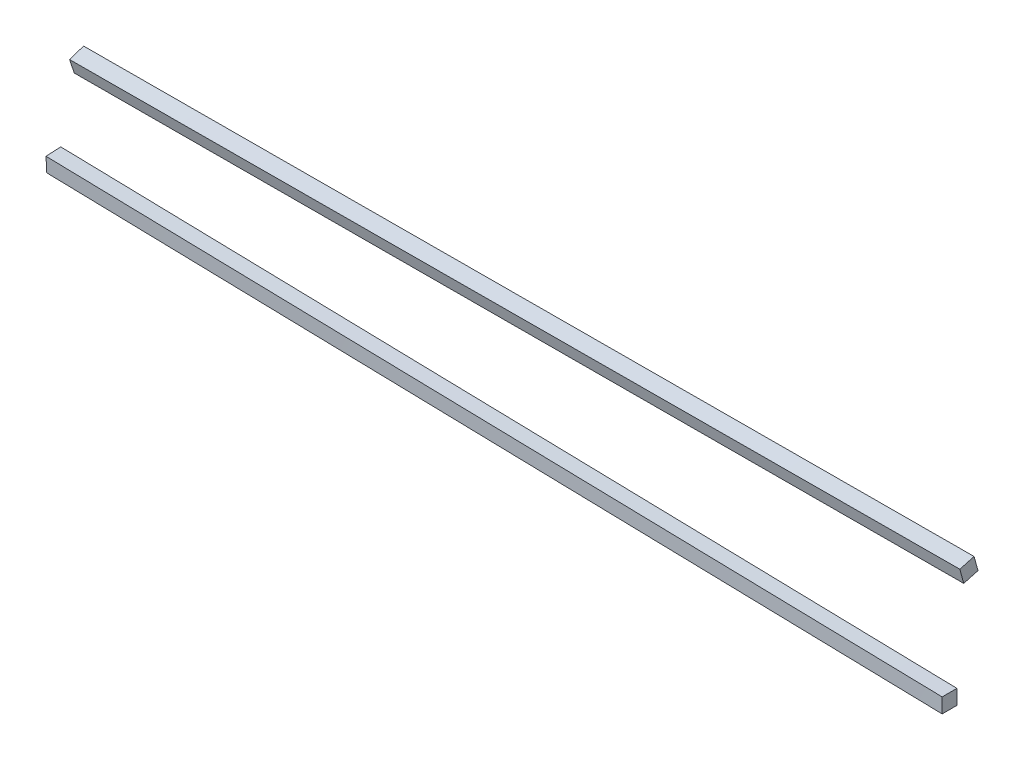
ISO-10303-21;
HEADER;
FILE_DESCRIPTION(('STEP AP214'),'2;1');
FILE_NAME('part.step','',(''),(''),'','','');
FILE_SCHEMA(('AUTOMOTIVE_DESIGN { 1 0 10303 214 1 1 1 1 }'));
ENDSEC;
DATA;
#1=APPLICATION_CONTEXT('core data for automotive mechanical design processes');
#2=APPLICATION_PROTOCOL_DEFINITION('international standard','automotive_design',2000,#1);
#3=PRODUCT_CONTEXT('',#1,'mechanical');
#4=PRODUCT('Part','Part','',(#3));
#5=PRODUCT_RELATED_PRODUCT_CATEGORY('part','',(#4));
#6=PRODUCT_DEFINITION_FORMATION('','',#4);
#7=PRODUCT_DEFINITION_CONTEXT('part definition',#1,'design');
#8=PRODUCT_DEFINITION('design','',#6,#7);
#9=PRODUCT_DEFINITION_SHAPE('','',#8);
#10=(LENGTH_UNIT() NAMED_UNIT(*) SI_UNIT(.MILLI.,.METRE.));
#11=(NAMED_UNIT(*) PLANE_ANGLE_UNIT() SI_UNIT($,.RADIAN.));
#12=(NAMED_UNIT(*) SI_UNIT($,.STERADIAN.) SOLID_ANGLE_UNIT());
#13=UNCERTAINTY_MEASURE_WITH_UNIT(LENGTH_MEASURE(1.E-05),#10,'distance_accuracy_value','');
#14=(GEOMETRIC_REPRESENTATION_CONTEXT(3) GLOBAL_UNCERTAINTY_ASSIGNED_CONTEXT((#13)) GLOBAL_UNIT_ASSIGNED_CONTEXT((#10,
#11,#12)) REPRESENTATION_CONTEXT('',''));
#15=CARTESIAN_POINT('',(0.,0.,0.));
#16=DIRECTION('',(0.,0.,1.));
#17=DIRECTION('',(1.,0.,0.));
#18=AXIS2_PLACEMENT_3D('',#15,#16,#17);
#19=CARTESIAN_POINT('',(-301.244,0.,0.));
#20=DIRECTION('',(1.,0.,0.));
#21=DIRECTION('',(0.,0.,1.));
#22=AXIS2_PLACEMENT_3D('',#19,#20,#21);
#23=PLANE('',#22);
#24=CARTESIAN_POINT('',(-301.244,-49.4935586732166,76.9043155989321));
#25=CARTESIAN_POINT('',(-301.244,-50.2968316977287,76.8630292912478));
#26=CARTESIAN_POINT('',(-301.244,-51.1001047222409,76.8217429835635));
#27=CARTESIAN_POINT('',(-301.244,-52.7066507712652,76.7391703681949));
#28=CARTESIAN_POINT('',(-301.244,-53.5099237957774,76.6978840605105));
#29=CARTESIAN_POINT('',(-301.244,-54.3131968202896,76.6565977528262));
#30=B_SPLINE_CURVE_WITH_KNOTS('',3,(#24,#25,#26,#27,#28,#29),.UNSPECIFIED.,.F.,.F.,(4,2,4),(0.,
0.5,1.),.UNSPECIFIED.);
#31=CARTESIAN_POINT('',(-301.244,-54.3131968202896,76.6565977528262));
#32=VERTEX_POINT('',#31);
#33=CARTESIAN_POINT('',(-301.244,-49.4935586732166,76.9043155989321));
#34=VERTEX_POINT('',#33);
#35=EDGE_CURVE('E150',#32,#34,#30,.F.);
#36=ORIENTED_EDGE('',*,*,#35,.T.);
#37=CARTESIAN_POINT('',(-301.244,-49.2458408271109,72.0846774518592));
#38=CARTESIAN_POINT('',(-301.244,-49.2871271347952,72.8879504763713));
#39=CARTESIAN_POINT('',(-301.244,-49.3284134424795,73.6912235008835));
#40=CARTESIAN_POINT('',(-301.244,-49.410986057848,75.2977695499078));
#41=CARTESIAN_POINT('',(-301.244,-49.4522723655323,76.10104257442));
#42=CARTESIAN_POINT('',(-301.244,-49.4935586732166,76.9043155989321));
#43=B_SPLINE_CURVE_WITH_KNOTS('',3,(#37,#38,#39,#40,#41,#42),.UNSPECIFIED.,.F.,.F.,(4,2,4),(0.,
0.5,1.),.UNSPECIFIED.);
#44=CARTESIAN_POINT('',(-301.244,-49.2458408271109,72.0846774518592));
#45=VERTEX_POINT('',#44);
#46=EDGE_CURVE('E288',#34,#45,#43,.F.);
#47=ORIENTED_EDGE('',*,*,#46,.T.);
#48=CARTESIAN_POINT('',(-301.244,-54.0654789741837,71.8369596057533));
#49=CARTESIAN_POINT('',(-301.244,-53.2622059496716,71.8782459134376));
#50=CARTESIAN_POINT('',(-301.244,-52.4589329251595,71.9195322211219));
#51=CARTESIAN_POINT('',(-301.244,-50.8523868761353,72.0021048364905));
#52=CARTESIAN_POINT('',(-301.244,-50.0491138516231,72.0433911441748));
#53=CARTESIAN_POINT('',(-301.244,-49.2458408271109,72.0846774518592));
#54=B_SPLINE_CURVE_WITH_KNOTS('',3,(#48,#49,#50,#51,#52,#53),.UNSPECIFIED.,.F.,.F.,(4,2,4),(0.,
0.5,1.),.UNSPECIFIED.);
#55=CARTESIAN_POINT('',(-301.244,-54.0654789741837,71.8369596057533));
#56=VERTEX_POINT('',#55);
#57=EDGE_CURVE('E109',#56,#45,#54,.T.);
#58=ORIENTED_EDGE('',*,*,#57,.F.);
#59=CARTESIAN_POINT('',(-301.244,-54.3131968202896,76.6565977528262));
#60=CARTESIAN_POINT('',(-301.244,-54.2719105126053,75.8533247283141));
#61=CARTESIAN_POINT('',(-301.244,-54.2306242049209,75.0500517038019));
#62=CARTESIAN_POINT('',(-301.244,-54.1480515895523,73.4435056547776));
#63=CARTESIAN_POINT('',(-301.244,-54.106765281868,72.6402326302655));
#64=CARTESIAN_POINT('',(-301.244,-54.0654789741837,71.8369596057533));
#65=B_SPLINE_CURVE_WITH_KNOTS('',3,(#59,#60,#61,#62,#63,#64),.UNSPECIFIED.,.F.,.F.,(4,2,4),(0.,
0.5,1.),.UNSPECIFIED.);
#66=EDGE_CURVE('E13',#32,#56,#65,.T.);
#67=ORIENTED_EDGE('',*,*,#66,.F.);
#68=EDGE_LOOP('',(#36,#47,#58,#67));
#69=FACE_BOUND('',#68,.T.);
#70=ADVANCED_FACE('F99',(#69),#23,.F.);
#71=CARTESIAN_POINT('',(0.,0.,0.));
#72=DIRECTION('',(-1.,0.,0.));
#73=DIRECTION('',(0.,0.,-1.));
#74=AXIS2_PLACEMENT_3D('',#71,#72,#73);
#75=PLANE('',#74);
#76=CARTESIAN_POINT('',(0.,-47.5379402375898,80.6119269532758));
#77=CARTESIAN_POINT('',(0.,-48.3422729674837,80.6109416957266));
#78=CARTESIAN_POINT('',(0.,-49.1466056973777,80.6099564381774));
#79=CARTESIAN_POINT('',(0.,-50.7552711571656,80.6079859230791));
#80=CARTESIAN_POINT('',(0.,-51.5596038870595,80.6070006655299));
#81=CARTESIAN_POINT('',(0.,-52.3639366169535,80.6060154079807));
#82=B_SPLINE_CURVE_WITH_KNOTS('',3,(#76,#77,#78,#79,#80,#81),.UNSPECIFIED.,.F.,.F.,(4,2,4),(0.,
0.5,1.),.UNSPECIFIED.);
#83=CARTESIAN_POINT('',(0.,-52.3639366169535,80.6060154079807));
#84=VERTEX_POINT('',#83);
#85=CARTESIAN_POINT('',(0.,-47.5379402375898,80.6119269532758));
#86=VERTEX_POINT('',#85);
#87=EDGE_CURVE('E143',#84,#86,#82,.F.);
#88=ORIENTED_EDGE('',*,*,#87,.T.);
#89=CARTESIAN_POINT('',(0.,-47.5438517828847,85.4379233326396));
#90=CARTESIAN_POINT('',(0.,-47.5428665253356,84.6335906027461));
#91=CARTESIAN_POINT('',(0.,-47.5418812677864,83.8292578728523));
#92=CARTESIAN_POINT('',(0.,-47.5399107526881,82.2205924130644));
#93=CARTESIAN_POINT('',(0.,-47.5389254951389,81.4162596831702));
#94=CARTESIAN_POINT('',(0.,-47.5379402375898,80.6119269532758));
#95=B_SPLINE_CURVE_WITH_KNOTS('',3,(#89,#90,#91,#92,#93,#94),.UNSPECIFIED.,.F.,.F.,(4,2,4),(0.,
0.5,1.),.UNSPECIFIED.);
#96=CARTESIAN_POINT('',(0.,-47.5438517828847,85.4379233326396));
#97=VERTEX_POINT('',#96);
#98=EDGE_CURVE('E153',#86,#97,#95,.F.);
#99=ORIENTED_EDGE('',*,*,#98,.T.);
#100=CARTESIAN_POINT('',(0.,-52.3698481622485,85.4320117873445));
#101=CARTESIAN_POINT('',(0.,-51.5655154323546,85.4329970448937));
#102=CARTESIAN_POINT('',(0.,-50.7611827024606,85.4339823024429));
#103=CARTESIAN_POINT('',(0.,-49.1525172426727,85.4359528175412));
#104=CARTESIAN_POINT('',(0.,-48.3481845127787,85.4369380750904));
#105=CARTESIAN_POINT('',(0.,-47.5438517828847,85.4379233326396));
#106=B_SPLINE_CURVE_WITH_KNOTS('',3,(#100,#101,#102,#103,#104,#105),.UNSPECIFIED.,.F.,.F.,(4,2,
4),(0.,0.5,1.),.UNSPECIFIED.);
#107=CARTESIAN_POINT('',(0.,-52.3698481622485,85.4320117873445));
#108=VERTEX_POINT('',#107);
#109=EDGE_CURVE('E161',#108,#97,#106,.T.);
#110=ORIENTED_EDGE('',*,*,#109,.F.);
#111=CARTESIAN_POINT('',(0.,-52.3639366169535,80.6060154079807));
#112=CARTESIAN_POINT('',(0.,-52.3649218745027,81.4103481378746));
#113=CARTESIAN_POINT('',(0.,-52.3659071320518,82.2146808677686));
#114=CARTESIAN_POINT('',(0.,-52.3678776471502,83.8233463275565));
#115=CARTESIAN_POINT('',(0.,-52.3688629046993,84.6276790574505));
#116=CARTESIAN_POINT('',(0.,-52.3698481622485,85.4320117873445));
#117=B_SPLINE_CURVE_WITH_KNOTS('',3,(#111,#112,#113,#114,#115,#116),.UNSPECIFIED.,.F.,.F.,(4,2,
4),(0.,0.5,1.),.UNSPECIFIED.);
#118=EDGE_CURVE('E167',#84,#108,#117,.T.);
#119=ORIENTED_EDGE('',*,*,#118,.F.);
#120=EDGE_LOOP('',(#88,#99,#110,#119));
#121=FACE_BOUND('',#120,.T.);
#122=ADVANCED_FACE('F166',(#121),#75,.F.);
#123=CARTESIAN_POINT('',(0.,-47.5438517828847,85.4379233326396));
#124=CARTESIAN_POINT('',(-301.244,-49.4935586732166,76.9043155989321));
#125=CARTESIAN_POINT('',(0.,-48.3481845127787,85.4369380750904));
#126=CARTESIAN_POINT('',(-301.244,-50.2968316977287,76.8630292912478));
#127=CARTESIAN_POINT('',(0.,-49.1525172426727,85.4359528175412));
#128=CARTESIAN_POINT('',(-301.244,-51.1001047222409,76.8217429835635));
#129=CARTESIAN_POINT('',(0.,-50.7611827024606,85.4339823024429));
#130=CARTESIAN_POINT('',(-301.244,-52.7066507712652,76.7391703681949));
#131=CARTESIAN_POINT('',(0.,-51.5655154323546,85.4329970448937));
#132=CARTESIAN_POINT('',(-301.244,-53.5099237957774,76.6978840605105));
#133=CARTESIAN_POINT('',(0.,-52.3698481622485,85.4320117873445));
#134=CARTESIAN_POINT('',(-301.244,-54.3131968202896,76.6565977528262));
#135=B_SPLINE_SURFACE_WITH_KNOTS('',3,1,((#123,#124),(#125,#126),(#127,#128),(#129,#130),(#131,
#132),(#133,#134)),.UNSPECIFIED.,.F.,.F.,.F.,(4,2,4),(2,2),(0.,0.5,1.),(0.,1.),.UNSPECIFIED.);
#136=DIRECTION('',(0.999578087821169,0.00646945428041606,0.0283159409006493));
#137=VECTOR('',#136,1.);
#138=CARTESIAN_POINT('',(-150.622,-48.5187052280507,81.1711194657858));
#139=LINE('',#138,#137);
#140=EDGE_CURVE('E156',#34,#97,#139,.T.);
#141=DIRECTION('',(-0.999555193249879,-0.00644820890520686,-0.0291176278070954));
#142=VECTOR('',#141,1.);
#143=CARTESIAN_POINT('',(-150.622,-53.341522491269,81.0443047700854));
#144=LINE('',#143,#142);
#145=EDGE_CURVE('E115',#108,#32,#144,.T.);
#146=ORIENTED_EDGE('',*,*,#109,.T.);
#147=ORIENTED_EDGE('',*,*,#140,.F.);
#148=ORIENTED_EDGE('',*,*,#35,.F.);
#149=ORIENTED_EDGE('',*,*,#145,.F.);
#150=EDGE_LOOP('',(#146,#147,#148,#149));
#151=FACE_BOUND('',#150,.T.);
#152=ADVANCED_FACE('F186',(#151),#135,.F.);
#153=CARTESIAN_POINT('',(0.,-52.3698481622485,85.4320117873445));
#154=CARTESIAN_POINT('',(-301.244,-54.3131968202896,76.6565977528262));
#155=CARTESIAN_POINT('',(0.,-52.3688629046993,84.6276790574505));
#156=CARTESIAN_POINT('',(-301.244,-54.2719105126053,75.8533247283141));
#157=CARTESIAN_POINT('',(0.,-52.3678776471502,83.8233463275565));
#158=CARTESIAN_POINT('',(-301.244,-54.2306242049209,75.0500517038019));
#159=CARTESIAN_POINT('',(0.,-52.3659071320518,82.2146808677686));
#160=CARTESIAN_POINT('',(-301.244,-54.1480515895523,73.4435056547776));
#161=CARTESIAN_POINT('',(0.,-52.3649218745027,81.4103481378746));
#162=CARTESIAN_POINT('',(-301.244,-54.106765281868,72.6402326302655));
#163=CARTESIAN_POINT('',(0.,-52.3639366169535,80.6060154079807));
#164=CARTESIAN_POINT('',(-301.244,-54.0654789741837,71.8369596057533));
#165=B_SPLINE_SURFACE_WITH_KNOTS('',3,1,((#153,#154),(#155,#156),(#157,#158),(#159,#160),(#161,
#162),(#163,#164)),.UNSPECIFIED.,.F.,.F.,.F.,(4,2,4),(2,2),(0.,0.5,1.),(0.,1.),.UNSPECIFIED.);
#166=DIRECTION('',(-0.999560656696797,-0.00564590430345644,-0.0290966896478778));
#167=VECTOR('',#166,1.);
#168=CARTESIAN_POINT('',(-150.622,-53.2147077955686,76.221487506867));
#169=LINE('',#168,#167);
#170=EDGE_CURVE('E123',#84,#56,#169,.T.);
#171=ORIENTED_EDGE('',*,*,#118,.T.);
#172=ORIENTED_EDGE('',*,*,#145,.T.);
#173=ORIENTED_EDGE('',*,*,#66,.T.);
#174=ORIENTED_EDGE('',*,*,#170,.F.);
#175=EDGE_LOOP('',(#171,#172,#173,#174));
#176=FACE_BOUND('',#175,.T.);
#177=ADVANCED_FACE('F229',(#176),#165,.F.);
#178=CARTESIAN_POINT('',(0.,-47.5379402375898,80.6119269532758));
#179=CARTESIAN_POINT('',(-301.244,-49.2458408271109,72.0846774518592));
#180=CARTESIAN_POINT('',(0.,-47.5389254951389,81.4162596831702));
#181=CARTESIAN_POINT('',(-301.244,-49.2871271347952,72.8879504763713));
#182=CARTESIAN_POINT('',(0.,-47.5399107526881,82.2205924130644));
#183=CARTESIAN_POINT('',(-301.244,-49.3284134424795,73.6912235008835));
#184=CARTESIAN_POINT('',(0.,-47.5418812677864,83.8292578728523));
#185=CARTESIAN_POINT('',(-301.244,-49.410986057848,75.2977695499078));
#186=CARTESIAN_POINT('',(0.,-47.5428665253356,84.6335906027461));
#187=CARTESIAN_POINT('',(-301.244,-49.4522723655323,76.10104257442));
#188=CARTESIAN_POINT('',(0.,-47.5438517828847,85.4379233326396));
#189=CARTESIAN_POINT('',(-301.244,-49.4935586732166,76.9043155989321));
#190=B_SPLINE_SURFACE_WITH_KNOTS('',3,1,((#178,#179),(#180,#181),(#182,#183),(#184,#185),(#186,
#187),(#188,#189)),.UNSPECIFIED.,.F.,.F.,.F.,(4,2,4),(2,2),(0.,0.5,1.),(0.,1.),.UNSPECIFIED.);
#191=DIRECTION('',(-0.999583551643514,-0.00566713141880874,-0.028294997883365));
#192=VECTOR('',#191,1.);
#193=CARTESIAN_POINT('',(-150.622,-48.3918905323504,76.3483022025675));
#194=LINE('',#193,#192);
#195=EDGE_CURVE('E139',#86,#45,#194,.T.);
#196=ORIENTED_EDGE('',*,*,#98,.F.);
#197=ORIENTED_EDGE('',*,*,#195,.T.);
#198=ORIENTED_EDGE('',*,*,#46,.F.);
#199=ORIENTED_EDGE('',*,*,#140,.T.);
#200=EDGE_LOOP('',(#196,#197,#198,#199));
#201=FACE_BOUND('',#200,.T.);
#202=ADVANCED_FACE('F155',(#201),#190,.F.);
#203=CARTESIAN_POINT('',(0.,-52.3639366169535,80.6060154079807));
#204=CARTESIAN_POINT('',(-301.244,-54.0654789741837,71.8369596057533));
#205=CARTESIAN_POINT('',(0.,-51.5596038870595,80.6070006655299));
#206=CARTESIAN_POINT('',(-301.244,-53.2622059496716,71.8782459134376));
#207=CARTESIAN_POINT('',(0.,-50.7552711571656,80.6079859230791));
#208=CARTESIAN_POINT('',(-301.244,-52.4589329251595,71.9195322211219));
#209=CARTESIAN_POINT('',(0.,-49.1466056973777,80.6099564381774));
#210=CARTESIAN_POINT('',(-301.244,-50.8523868761353,72.0021048364905));
#211=CARTESIAN_POINT('',(0.,-48.3422729674837,80.6109416957266));
#212=CARTESIAN_POINT('',(-301.244,-50.0491138516231,72.0433911441748));
#213=CARTESIAN_POINT('',(0.,-47.5379402375898,80.6119269532758));
#214=CARTESIAN_POINT('',(-301.244,-49.2458408271109,72.0846774518592));
#215=B_SPLINE_SURFACE_WITH_KNOTS('',3,1,((#203,#204),(#205,#206),(#207,#208),(#209,#210),(#211,
#212),(#213,#214)),.UNSPECIFIED.,.F.,.F.,.F.,(4,2,4),(2,2),(0.,0.5,1.),(0.,1.),.UNSPECIFIED.);
#216=ORIENTED_EDGE('',*,*,#87,.F.);
#217=ORIENTED_EDGE('',*,*,#170,.T.);
#218=ORIENTED_EDGE('',*,*,#57,.T.);
#219=ORIENTED_EDGE('',*,*,#195,.F.);
#220=EDGE_LOOP('',(#216,#217,#218,#219));
#221=FACE_BOUND('',#220,.T.);
#222=ADVANCED_FACE('F141',(#221),#215,.F.);
#223=CLOSED_SHELL('',(#70,#122,#152,#177,#202,#222));
#224=MANIFOLD_SOLID_BREP('B2',#223);
#225=CARTESIAN_POINT('',(-301.244,0.,0.));
#226=DIRECTION('',(1.,0.,0.));
#227=DIRECTION('',(0.,0.,1.));
#228=AXIS2_PLACEMENT_3D('',#225,#226,#227);
#229=PLANE('',#228);
#230=CARTESIAN_POINT('',(-301.244,-25.986377888665,69.2072065287391));
#231=CARTESIAN_POINT('',(-301.244,-26.7493665473648,68.9526472668636));
#232=CARTESIAN_POINT('',(-301.244,-27.5123552060646,68.698088004988));
#233=CARTESIAN_POINT('',(-301.244,-29.0383325234642,68.1889694812369));
#234=CARTESIAN_POINT('',(-301.244,-29.8013211821639,67.9344102193614));
#235=CARTESIAN_POINT('',(-301.244,-30.5643098408637,67.6798509574859));
#236=B_SPLINE_CURVE_WITH_KNOTS('',3,(#230,#231,#232,#233,#234,#235),.UNSPECIFIED.,.F.,.F.,(4,2,
4),(0.,0.5,1.),.UNSPECIFIED.);
#237=CARTESIAN_POINT('',(-301.244,-30.5643098408637,67.6798509574859));
#238=VERTEX_POINT('',#237);
#239=CARTESIAN_POINT('',(-301.244,-25.986377888665,69.2072065287391));
#240=VERTEX_POINT('',#239);
#241=EDGE_CURVE('E566',#238,#240,#236,.F.);
#242=ORIENTED_EDGE('',*,*,#241,.T.);
#243=CARTESIAN_POINT('',(-301.244,-24.4590223174117,64.6292745765404));
#244=CARTESIAN_POINT('',(-301.244,-24.7135815792873,65.3922632352402));
#245=CARTESIAN_POINT('',(-301.244,-24.9681408411628,66.15525189394));
#246=CARTESIAN_POINT('',(-301.244,-25.4772593649139,67.6812292113396));
#247=CARTESIAN_POINT('',(-301.244,-25.7318186267895,68.4442178700394));
#248=CARTESIAN_POINT('',(-301.244,-25.986377888665,69.2072065287391));
#249=B_SPLINE_CURVE_WITH_KNOTS('',3,(#243,#244,#245,#246,#247,#248),.UNSPECIFIED.,.F.,.F.,(4,2,
4),(0.,0.5,1.),.UNSPECIFIED.);
#250=CARTESIAN_POINT('',(-301.244,-24.4590223174117,64.6292745765404));
#251=VERTEX_POINT('',#250);
#252=EDGE_CURVE('E558',#240,#251,#249,.F.);
#253=ORIENTED_EDGE('',*,*,#252,.T.);
#254=CARTESIAN_POINT('',(-301.244,-29.0369542696104,63.1019190052872));
#255=CARTESIAN_POINT('',(-301.244,-28.2739656109106,63.3564782671627));
#256=CARTESIAN_POINT('',(-301.244,-27.5109769522109,63.6110375290382));
#257=CARTESIAN_POINT('',(-301.244,-25.9849996348113,64.1201560527893));
#258=CARTESIAN_POINT('',(-301.244,-25.2220109761115,64.3747153146649));
#259=CARTESIAN_POINT('',(-301.244,-24.4590223174117,64.6292745765404));
#260=B_SPLINE_CURVE_WITH_KNOTS('',3,(#254,#255,#256,#257,#258,#259),.UNSPECIFIED.,.F.,.F.,(4,2,
4),(0.,0.5,1.),.UNSPECIFIED.);
#261=CARTESIAN_POINT('',(-301.244,-29.0369542696104,63.1019190052872));
#262=VERTEX_POINT('',#261);
#263=EDGE_CURVE('E433',#262,#251,#260,.T.);
#264=ORIENTED_EDGE('',*,*,#263,.F.);
#265=CARTESIAN_POINT('',(-301.244,-30.5643098408637,67.6798509574859));
#266=CARTESIAN_POINT('',(-301.244,-30.3097505789882,66.916862298786));
#267=CARTESIAN_POINT('',(-301.244,-30.0551913171126,66.1538736400862));
#268=CARTESIAN_POINT('',(-301.244,-29.5460727933615,64.6278963226867));
#269=CARTESIAN_POINT('',(-301.244,-29.291513531486,63.8649076639869));
#270=CARTESIAN_POINT('',(-301.244,-29.0369542696104,63.1019190052872));
#271=B_SPLINE_CURVE_WITH_KNOTS('',3,(#265,#266,#267,#268,#269,#270),.UNSPECIFIED.,.F.,.F.,(4,2,
4),(0.,0.5,1.),.UNSPECIFIED.);
#272=EDGE_CURVE('E97',#238,#262,#271,.T.);
#273=ORIENTED_EDGE('',*,*,#272,.F.);
#274=EDGE_LOOP('',(#242,#253,#264,#273));
#275=FACE_BOUND('',#274,.T.);
#276=ADVANCED_FACE('F423',(#275),#229,.F.);
#277=CARTESIAN_POINT('',(0.,0.,0.));
#278=DIRECTION('',(1.,0.,0.));
#279=DIRECTION('',(0.,0.,1.));
#280=AXIS2_PLACEMENT_3D('',#277,#278,#279);
#281=PLANE('',#280);
#282=CARTESIAN_POINT('',(0.,-17.6892857922132,73.7225928427553));
#283=CARTESIAN_POINT('',(0.,-17.9023898772861,74.4981821413124));
#284=CARTESIAN_POINT('',(0.,-18.115493962359,75.2737714398696));
#285=CARTESIAN_POINT('',(0.,-18.5417021325049,76.8249500369839));
#286=CARTESIAN_POINT('',(0.,-18.7548062175778,77.600539335541));
#287=CARTESIAN_POINT('',(0.,-18.9679103026507,78.3761286340981));
#288=B_SPLINE_CURVE_WITH_KNOTS('',3,(#282,#283,#284,#285,#286,#287),.UNSPECIFIED.,.F.,.F.,(4,2,
4),(0.,0.5,1.),.UNSPECIFIED.);
#289=CARTESIAN_POINT('',(0.,-17.6892857922132,73.7225928427553));
#290=VERTEX_POINT('',#289);
#291=CARTESIAN_POINT('',(0.,-18.9679103026507,78.3761286340981));
#292=VERTEX_POINT('',#291);
#293=EDGE_CURVE('E490',#290,#292,#288,.T.);
#294=ORIENTED_EDGE('',*,*,#293,.F.);
#295=CARTESIAN_POINT('',(0.,-13.0357500008704,75.0012173531927));
#296=CARTESIAN_POINT('',(0.,-13.8113392994275,74.7881132681198));
#297=CARTESIAN_POINT('',(0.,-14.5869285979847,74.5750091830469));
#298=CARTESIAN_POINT('',(0.,-16.1381071950989,74.1488010129011));
#299=CARTESIAN_POINT('',(0.,-16.9136964936561,73.9356969278282));
#300=CARTESIAN_POINT('',(0.,-17.6892857922132,73.7225928427553));
#301=B_SPLINE_CURVE_WITH_KNOTS('',3,(#295,#296,#297,#298,#299,#300),.UNSPECIFIED.,.F.,.F.,(4,2,
4),(0.,0.5,1.),.UNSPECIFIED.);
#302=CARTESIAN_POINT('',(0.,-13.0357500008704,75.0012173531927));
#303=VERTEX_POINT('',#302);
#304=EDGE_CURVE('E467',#290,#303,#301,.F.);
#305=ORIENTED_EDGE('',*,*,#304,.T.);
#306=CARTESIAN_POINT('',(0.,-14.3143745113079,79.6547531445356));
#307=CARTESIAN_POINT('',(0.,-14.1012704262349,78.8791638459783));
#308=CARTESIAN_POINT('',(0.,-13.888166341162,78.1035745474211));
#309=CARTESIAN_POINT('',(0.,-13.4619581710162,76.5523959503069));
#310=CARTESIAN_POINT('',(0.,-13.2488540859433,75.7768066517498));
#311=CARTESIAN_POINT('',(0.,-13.0357500008704,75.0012173531927));
#312=B_SPLINE_CURVE_WITH_KNOTS('',3,(#306,#307,#308,#309,#310,#311),.UNSPECIFIED.,.F.,.F.,(4,2,
4),(0.,0.5,1.),.UNSPECIFIED.);
#313=CARTESIAN_POINT('',(0.,-14.3143745113079,79.6547531445356));
#314=VERTEX_POINT('',#313);
#315=EDGE_CURVE('E478',#303,#314,#312,.F.);
#316=ORIENTED_EDGE('',*,*,#315,.T.);
#317=CARTESIAN_POINT('',(0.,-18.9679103026507,78.3761286340981));
#318=CARTESIAN_POINT('',(0.,-18.1923210040935,78.589232719171));
#319=CARTESIAN_POINT('',(0.,-17.4167317055364,78.8023368042439));
#320=CARTESIAN_POINT('',(0.,-15.8655531084221,79.2285449743897));
#321=CARTESIAN_POINT('',(0.,-15.089963809865,79.4416490594627));
#322=CARTESIAN_POINT('',(0.,-14.3143745113079,79.6547531445356));
#323=B_SPLINE_CURVE_WITH_KNOTS('',3,(#317,#318,#319,#320,#321,#322),.UNSPECIFIED.,.F.,.F.,(4,2,
4),(0.,0.5,1.),.UNSPECIFIED.);
#324=EDGE_CURVE('E485',#292,#314,#323,.T.);
#325=ORIENTED_EDGE('',*,*,#324,.F.);
#326=EDGE_LOOP('',(#294,#305,#316,#325));
#327=FACE_BOUND('',#326,.T.);
#328=ADVANCED_FACE('F489',(#327),#281,.T.);
#329=CARTESIAN_POINT('',(0.,-13.0357500008704,75.0012173531927));
#330=CARTESIAN_POINT('',(-301.244,-24.4590223174117,64.6292745765404));
#331=CARTESIAN_POINT('',(0.,-13.2488540859433,75.7768066517498));
#332=CARTESIAN_POINT('',(-301.244,-24.7135815792873,65.3922632352402));
#333=CARTESIAN_POINT('',(0.,-13.4619581710162,76.5523959503069));
#334=CARTESIAN_POINT('',(-301.244,-24.9681408411628,66.15525189394));
#335=CARTESIAN_POINT('',(0.,-13.888166341162,78.1035745474211));
#336=CARTESIAN_POINT('',(-301.244,-25.4772593649139,67.6812292113396));
#337=CARTESIAN_POINT('',(0.,-14.1012704262349,78.8791638459783));
#338=CARTESIAN_POINT('',(-301.244,-25.7318186267895,68.4442178700394));
#339=CARTESIAN_POINT('',(0.,-14.3143745113079,79.6547531445356));
#340=CARTESIAN_POINT('',(-301.244,-25.986377888665,69.2072065287391));
#341=B_SPLINE_SURFACE_WITH_KNOTS('',3,1,((#329,#330),(#331,#332),(#333,#334),(#335,#336),(#337,
#338),(#339,#340)),.UNSPECIFIED.,.F.,.F.,.F.,(4,2,4),(2,2),(0.,0.5,1.),(0.,1.),.UNSPECIFIED.);
#342=DIRECTION('',(0.998690874208296,0.0378706889303227,0.0343852976286774));
#343=VECTOR('',#342,1.);
#344=CARTESIAN_POINT('',(-150.622,-18.7473861591411,69.8152459648666));
#345=LINE('',#344,#343);
#346=EDGE_CURVE('E463',#251,#303,#345,.T.);
#347=DIRECTION('',(-0.99865071131137,-0.0386937315771483,-0.0346345482709159));
#348=VECTOR('',#347,1.);
#349=CARTESIAN_POINT('',(-150.622,-20.1503761999865,74.4309798366373));
#350=LINE('',#349,#348);
#351=EDGE_CURVE('E475',#314,#240,#350,.T.);
#352=ORIENTED_EDGE('',*,*,#315,.F.);
#353=ORIENTED_EDGE('',*,*,#346,.F.);
#354=ORIENTED_EDGE('',*,*,#252,.F.);
#355=ORIENTED_EDGE('',*,*,#351,.F.);
#356=EDGE_LOOP('',(#352,#353,#354,#355));
#357=FACE_BOUND('',#356,.T.);
#358=ADVANCED_FACE('F480',(#357),#341,.F.);
#359=CARTESIAN_POINT('',(0.,-14.3143745113079,79.6547531445356));
#360=CARTESIAN_POINT('',(-301.244,-25.986377888665,69.2072065287391));
#361=CARTESIAN_POINT('',(0.,-15.089963809865,79.4416490594627));
#362=CARTESIAN_POINT('',(-301.244,-26.7493665473648,68.9526472668636));
#363=CARTESIAN_POINT('',(0.,-15.8655531084221,79.2285449743897));
#364=CARTESIAN_POINT('',(-301.244,-27.5123552060646,68.698088004988));
#365=CARTESIAN_POINT('',(0.,-17.4167317055364,78.8023368042439));
#366=CARTESIAN_POINT('',(-301.244,-29.0383325234642,68.1889694812369));
#367=CARTESIAN_POINT('',(0.,-18.1923210040935,78.589232719171));
#368=CARTESIAN_POINT('',(-301.244,-29.8013211821639,67.9344102193614));
#369=CARTESIAN_POINT('',(0.,-18.9679103026507,78.3761286340981));
#370=CARTESIAN_POINT('',(-301.244,-30.5643098408637,67.6798509574859));
#371=B_SPLINE_SURFACE_WITH_KNOTS('',3,1,((#359,#360),(#361,#362),(#363,#364),(#365,#366),(#367,
#368),(#369,#370)),.UNSPECIFIED.,.F.,.F.,.F.,(4,2,4),(2,2),(0.,0.5,1.),(0.,1.),.UNSPECIFIED.);
#372=DIRECTION('',(-0.998631505937625,-0.0384423587998436,-0.0354584319824537));
#373=VECTOR('',#372,1.);
#374=CARTESIAN_POINT('',(-150.622,-24.7661100717572,73.027989795792));
#375=LINE('',#374,#373);
#376=EDGE_CURVE('E439',#292,#238,#375,.T.);
#377=ORIENTED_EDGE('',*,*,#324,.T.);
#378=ORIENTED_EDGE('',*,*,#351,.T.);
#379=ORIENTED_EDGE('',*,*,#241,.F.);
#380=ORIENTED_EDGE('',*,*,#376,.F.);
#381=EDGE_LOOP('',(#377,#378,#379,#380));
#382=FACE_BOUND('',#381,.T.);
#383=ADVANCED_FACE('F587',(#382),#371,.F.);
#384=CARTESIAN_POINT('',(0.,-17.6892857922132,73.7225928427553));
#385=CARTESIAN_POINT('',(-301.244,-29.0369542696104,63.1019190052872));
#386=CARTESIAN_POINT('',(0.,-16.9136964936561,73.9356969278282));
#387=CARTESIAN_POINT('',(-301.244,-28.2739656109106,63.3564782671627));
#388=CARTESIAN_POINT('',(0.,-16.1381071950989,74.1488010129011));
#389=CARTESIAN_POINT('',(-301.244,-27.5109769522109,63.6110375290382));
#390=CARTESIAN_POINT('',(0.,-14.5869285979847,74.5750091830469));
#391=CARTESIAN_POINT('',(-301.244,-25.9849996348113,64.1201560527893));
#392=CARTESIAN_POINT('',(0.,-13.8113392994275,74.7881132681198));
#393=CARTESIAN_POINT('',(-301.244,-25.2220109761115,64.3747153146649));
#394=CARTESIAN_POINT('',(0.,-13.0357500008704,75.0012173531927));
#395=CARTESIAN_POINT('',(-301.244,-24.4590223174117,64.6292745765404));
#396=B_SPLINE_SURFACE_WITH_KNOTS('',3,1,((#384,#385),(#386,#387),(#388,#389),(#390,#391),(#392,
#393),(#394,#395)),.UNSPECIFIED.,.F.,.F.,.F.,(4,2,4),(2,2),(0.,0.5,1.),(0.,1.),.UNSPECIFIED.);
#397=DIRECTION('',(-0.998671666517346,-0.0376193218434513,-0.035209219240222));
#398=VECTOR('',#397,1.);
#399=CARTESIAN_POINT('',(-150.622,-23.3631200309118,68.4122559240212));
#400=LINE('',#399,#398);
#401=EDGE_CURVE('E447',#290,#262,#400,.T.);
#402=ORIENTED_EDGE('',*,*,#304,.F.);
#403=ORIENTED_EDGE('',*,*,#401,.T.);
#404=ORIENTED_EDGE('',*,*,#263,.T.);
#405=ORIENTED_EDGE('',*,*,#346,.T.);
#406=EDGE_LOOP('',(#402,#403,#404,#405));
#407=FACE_BOUND('',#406,.T.);
#408=ADVANCED_FACE('F465',(#407),#396,.F.);
#409=CARTESIAN_POINT('',(0.,-18.9679103026507,78.3761286340981));
#410=CARTESIAN_POINT('',(-301.244,-30.5643098408637,67.6798509574859));
#411=CARTESIAN_POINT('',(0.,-18.7548062175778,77.600539335541));
#412=CARTESIAN_POINT('',(-301.244,-30.3097505789882,66.916862298786));
#413=CARTESIAN_POINT('',(0.,-18.5417021325049,76.8249500369839));
#414=CARTESIAN_POINT('',(-301.244,-30.0551913171126,66.1538736400862));
#415=CARTESIAN_POINT('',(0.,-18.115493962359,75.2737714398696));
#416=CARTESIAN_POINT('',(-301.244,-29.5460727933615,64.6278963226867));
#417=CARTESIAN_POINT('',(0.,-17.9023898772861,74.4981821413124));
#418=CARTESIAN_POINT('',(-301.244,-29.291513531486,63.8649076639869));
#419=CARTESIAN_POINT('',(0.,-17.6892857922132,73.7225928427553));
#420=CARTESIAN_POINT('',(-301.244,-29.0369542696104,63.1019190052872));
#421=B_SPLINE_SURFACE_WITH_KNOTS('',3,1,((#409,#410),(#411,#412),(#413,#414),(#415,#416),(#417,
#418),(#419,#420)),.UNSPECIFIED.,.F.,.F.,.F.,(4,2,4),(2,2),(0.,0.5,1.),(0.,1.),.UNSPECIFIED.);
#422=ORIENTED_EDGE('',*,*,#293,.T.);
#423=ORIENTED_EDGE('',*,*,#376,.T.);
#424=ORIENTED_EDGE('',*,*,#272,.T.);
#425=ORIENTED_EDGE('',*,*,#401,.F.);
#426=EDGE_LOOP('',(#422,#423,#424,#425));
#427=FACE_BOUND('',#426,.T.);
#428=ADVANCED_FACE('F586',(#427),#421,.F.);
#429=CLOSED_SHELL('',(#276,#328,#358,#383,#408,#428));
#430=MANIFOLD_SOLID_BREP('B7',#429);
#431=ADVANCED_BREP_SHAPE_REPRESENTATION('',(#18,#224,#430),#14);
#432=SHAPE_DEFINITION_REPRESENTATION(#9,#431);
ENDSEC;
END-ISO-10303-21;
